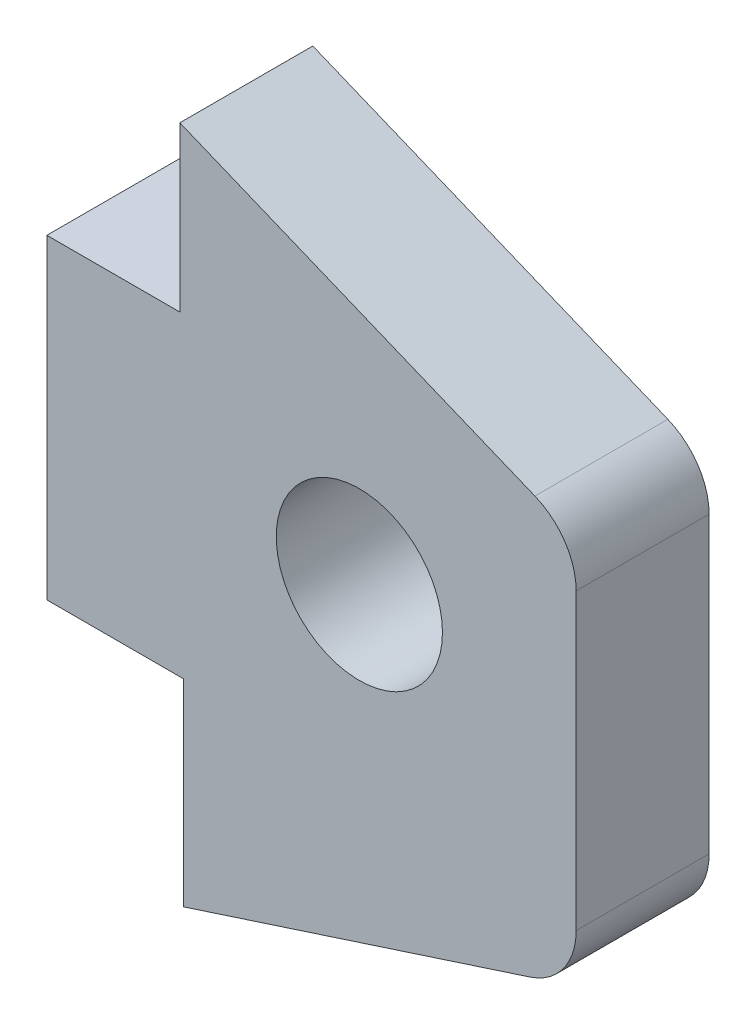
ISO-10303-21;
HEADER;
FILE_DESCRIPTION(('STEP AP214'),'2;1');
FILE_NAME('part.step','',(''),(''),'','','');
FILE_SCHEMA(('AUTOMOTIVE_DESIGN { 1 0 10303 214 1 1 1 1 }'));
ENDSEC;
DATA;
#1=APPLICATION_CONTEXT('core data for automotive mechanical design processes');
#2=APPLICATION_PROTOCOL_DEFINITION('international standard','automotive_design',2000,#1);
#3=PRODUCT_CONTEXT('',#1,'mechanical');
#4=PRODUCT('Part','Part','',(#3));
#5=PRODUCT_RELATED_PRODUCT_CATEGORY('part','',(#4));
#6=PRODUCT_DEFINITION_FORMATION('','',#4);
#7=PRODUCT_DEFINITION_CONTEXT('part definition',#1,'design');
#8=PRODUCT_DEFINITION('design','',#6,#7);
#9=PRODUCT_DEFINITION_SHAPE('','',#8);
#10=(LENGTH_UNIT() NAMED_UNIT(*) SI_UNIT(.MILLI.,.METRE.));
#11=(NAMED_UNIT(*) PLANE_ANGLE_UNIT() SI_UNIT($,.RADIAN.));
#12=(NAMED_UNIT(*) SI_UNIT($,.STERADIAN.) SOLID_ANGLE_UNIT());
#13=UNCERTAINTY_MEASURE_WITH_UNIT(LENGTH_MEASURE(1.E-05),#10,'distance_accuracy_value','');
#14=(GEOMETRIC_REPRESENTATION_CONTEXT(3) GLOBAL_UNCERTAINTY_ASSIGNED_CONTEXT((#13)) GLOBAL_UNIT_ASSIGNED_CONTEXT((#10,
#11,#12)) REPRESENTATION_CONTEXT('',''));
#15=CARTESIAN_POINT('',(0.,0.,0.));
#16=DIRECTION('',(0.,0.,1.));
#17=DIRECTION('',(1.,0.,0.));
#18=AXIS2_PLACEMENT_3D('',#15,#16,#17);
#19=CARTESIAN_POINT('',(0.,0.,4.));
#20=DIRECTION('',(0.,0.,1.));
#21=DIRECTION('',(1.,0.,0.));
#22=AXIS2_PLACEMENT_3D('',#19,#20,#21);
#23=PLANE('',#22);
#24=DIRECTION('',(0.951171408125809,0.308663169756234,0.));
#25=VECTOR('',#24,1.);
#26=CARTESIAN_POINT('',(4.10733066594974,-15.4415005076139,4.));
#27=LINE('',#26,#25);
#28=CARTESIAN_POINT('',(4.10733066594974,-15.4415005076139,4.));
#29=VERTEX_POINT('',#28);
#30=CARTESIAN_POINT('',(14.5396795010342,-12.0561150429848,4.));
#31=VERTEX_POINT('',#30);
#32=EDGE_CURVE('E173',#29,#31,#27,.T.);
#33=ORIENTED_EDGE('',*,*,#32,.T.);
#34=CARTESIAN_POINT('',(13.9223531615218,-10.1537722267332,4.));
#35=DIRECTION('',(0.,0.,1.));
#36=DIRECTION('',(1.,0.,0.));
#37=AXIS2_PLACEMENT_3D('',#34,#35,#36);
#38=CIRCLE('',#37,2.);
#39=CARTESIAN_POINT('',(15.9223531615218,-10.1537722267332,4.));
#40=VERTEX_POINT('',#39);
#41=EDGE_CURVE('E48',#31,#40,#38,.T.);
#42=ORIENTED_EDGE('',*,*,#41,.T.);
#43=DIRECTION('',(0.,1.,0.));
#44=VECTOR('',#43,1.);
#45=CARTESIAN_POINT('',(15.9223531615218,-11.6074257414156,4.));
#46=LINE('',#45,#44);
#47=CARTESIAN_POINT('',(15.9223531615218,-1.30359846331892,4.));
#48=VERTEX_POINT('',#47);
#49=EDGE_CURVE('E172',#40,#48,#46,.T.);
#50=ORIENTED_EDGE('',*,*,#49,.T.);
#51=CARTESIAN_POINT('',(13.9223531615218,-1.30359846331892,4.));
#52=DIRECTION('',(0.,0.,1.));
#53=DIRECTION('',(1.,0.,0.));
#54=AXIS2_PLACEMENT_3D('',#51,#52,#53);
#55=CIRCLE('',#54,2.);
#56=CARTESIAN_POINT('',(14.6817374813834,0.546627321483668,4.));
#57=VERTEX_POINT('',#56);
#58=EDGE_CURVE('E55',#48,#57,#55,.T.);
#59=ORIENTED_EDGE('',*,*,#58,.T.);
#60=DIRECTION('',(-0.925112892401295,0.379692159930792,0.));
#61=VECTOR('',#60,1.);
#62=CARTESIAN_POINT('',(15.9223531615218,0.037444008717305,4.));
#63=LINE('',#62,#61);
#64=CARTESIAN_POINT('',(4.,4.93071061492115,4.));
#65=VERTEX_POINT('',#64);
#66=EDGE_CURVE('E182',#57,#65,#63,.T.);
#67=ORIENTED_EDGE('',*,*,#66,.T.);
#68=DIRECTION('',(0.,-1.,0.));
#69=VECTOR('',#68,1.);
#70=CARTESIAN_POINT('',(4.,4.93071061492115,4.));
#71=LINE('',#70,#69);
#72=CARTESIAN_POINT('',(4.,0.,4.));
#73=VERTEX_POINT('',#72);
#74=EDGE_CURVE('E136',#65,#73,#71,.T.);
#75=ORIENTED_EDGE('',*,*,#74,.T.);
#76=DIRECTION('',(-1.,0.,0.));
#77=VECTOR('',#76,1.);
#78=CARTESIAN_POINT('',(4.,0.,4.));
#79=LINE('',#78,#77);
#80=CARTESIAN_POINT('',(0.,0.,4.));
#81=VERTEX_POINT('',#80);
#82=EDGE_CURVE('E131',#73,#81,#79,.T.);
#83=ORIENTED_EDGE('',*,*,#82,.T.);
#84=DIRECTION('',(0.,-1.,0.));
#85=VECTOR('',#84,1.);
#86=CARTESIAN_POINT('',(0.,0.,4.));
#87=LINE('',#86,#85);
#88=CARTESIAN_POINT('',(0.,-9.5,4.));
#89=VERTEX_POINT('',#88);
#90=EDGE_CURVE('E120',#81,#89,#87,.T.);
#91=ORIENTED_EDGE('',*,*,#90,.T.);
#92=DIRECTION('',(1.,0.,0.));
#93=VECTOR('',#92,1.);
#94=CARTESIAN_POINT('',(0.,-9.5,4.));
#95=LINE('',#94,#93);
#96=CARTESIAN_POINT('',(4.10733066594974,-9.5,4.));
#97=VERTEX_POINT('',#96);
#98=EDGE_CURVE('E130',#89,#97,#95,.T.);
#99=ORIENTED_EDGE('',*,*,#98,.T.);
#100=DIRECTION('',(0.,-1.,0.));
#101=VECTOR('',#100,1.);
#102=CARTESIAN_POINT('',(4.10733066594974,-9.5,4.));
#103=LINE('',#102,#101);
#104=EDGE_CURVE('E225',#97,#29,#103,.T.);
#105=ORIENTED_EDGE('',*,*,#104,.T.);
#106=EDGE_LOOP('',(#33,#42,#50,#59,#67,#75,#83,#91,#99,#105));
#107=FACE_BOUND('',#106,.T.);
#108=CARTESIAN_POINT('',(9.4,-4.4,4.));
#109=DIRECTION('',(0.,0.,1.));
#110=DIRECTION('',(1.,0.,0.));
#111=AXIS2_PLACEMENT_3D('',#108,#109,#110);
#112=CIRCLE('',#111,2.5);
#113=CARTESIAN_POINT('',(11.9,-4.4,4.));
#114=VERTEX_POINT('',#113);
#115=EDGE_CURVE('E235',#114,#114,#112,.T.);
#116=ORIENTED_EDGE('',*,*,#115,.F.);
#117=EDGE_LOOP('',(#116));
#118=FACE_BOUND('',#117,.T.);
#119=ADVANCED_FACE('F39',(#107,#118),#23,.T.);
#120=CARTESIAN_POINT('',(0.,0.,0.));
#121=DIRECTION('',(0.,0.,1.));
#122=DIRECTION('',(1.,0.,0.));
#123=AXIS2_PLACEMENT_3D('',#120,#121,#122);
#124=PLANE('',#123);
#125=DIRECTION('',(0.,1.,0.));
#126=VECTOR('',#125,1.);
#127=CARTESIAN_POINT('',(15.9223531615218,-11.6074257414156,0.));
#128=LINE('',#127,#126);
#129=CARTESIAN_POINT('',(15.9223531615218,-10.1537722267332,0.));
#130=VERTEX_POINT('',#129);
#131=CARTESIAN_POINT('',(15.9223531615218,-1.30359846331892,0.));
#132=VERTEX_POINT('',#131);
#133=EDGE_CURVE('E191',#130,#132,#128,.T.);
#134=ORIENTED_EDGE('',*,*,#133,.F.);
#135=CARTESIAN_POINT('',(13.9223531615218,-10.1537722267332,0.));
#136=DIRECTION('',(0.,0.,1.));
#137=DIRECTION('',(1.,0.,0.));
#138=AXIS2_PLACEMENT_3D('',#135,#136,#137);
#139=CIRCLE('',#138,2.);
#140=CARTESIAN_POINT('',(14.5396795010342,-12.0561150429848,0.));
#141=VERTEX_POINT('',#140);
#142=EDGE_CURVE('E163',#130,#141,#139,.F.);
#143=ORIENTED_EDGE('',*,*,#142,.T.);
#144=DIRECTION('',(0.951171408125809,0.308663169756234,0.));
#145=VECTOR('',#144,1.);
#146=CARTESIAN_POINT('',(4.10733066594974,-15.4415005076139,0.));
#147=LINE('',#146,#145);
#148=CARTESIAN_POINT('',(4.10733066594974,-15.4415005076139,0.));
#149=VERTEX_POINT('',#148);
#150=EDGE_CURVE('E190',#149,#141,#147,.T.);
#151=ORIENTED_EDGE('',*,*,#150,.F.);
#152=DIRECTION('',(0.,-1.,0.));
#153=VECTOR('',#152,1.);
#154=CARTESIAN_POINT('',(4.10733066594974,-9.5,0.));
#155=LINE('',#154,#153);
#156=CARTESIAN_POINT('',(4.10733066594974,-9.5,0.));
#157=VERTEX_POINT('',#156);
#158=EDGE_CURVE('E197',#157,#149,#155,.T.);
#159=ORIENTED_EDGE('',*,*,#158,.F.);
#160=DIRECTION('',(1.,0.,0.));
#161=VECTOR('',#160,1.);
#162=CARTESIAN_POINT('',(0.,-9.5,0.));
#163=LINE('',#162,#161);
#164=CARTESIAN_POINT('',(0.,-9.5,0.));
#165=VERTEX_POINT('',#164);
#166=EDGE_CURVE('E203',#165,#157,#163,.T.);
#167=ORIENTED_EDGE('',*,*,#166,.F.);
#168=DIRECTION('',(0.,-1.,0.));
#169=VECTOR('',#168,1.);
#170=CARTESIAN_POINT('',(0.,0.,0.));
#171=LINE('',#170,#169);
#172=CARTESIAN_POINT('',(0.,0.,0.));
#173=VERTEX_POINT('',#172);
#174=EDGE_CURVE('E228',#173,#165,#171,.T.);
#175=ORIENTED_EDGE('',*,*,#174,.F.);
#176=DIRECTION('',(-1.,0.,0.));
#177=VECTOR('',#176,1.);
#178=CARTESIAN_POINT('',(4.,0.,0.));
#179=LINE('',#178,#177);
#180=CARTESIAN_POINT('',(4.,0.,0.));
#181=VERTEX_POINT('',#180);
#182=EDGE_CURVE('E145',#181,#173,#179,.T.);
#183=ORIENTED_EDGE('',*,*,#182,.F.);
#184=DIRECTION('',(0.,-1.,0.));
#185=VECTOR('',#184,1.);
#186=CARTESIAN_POINT('',(4.,4.93071061492115,0.));
#187=LINE('',#186,#185);
#188=CARTESIAN_POINT('',(4.,4.93071061492115,0.));
#189=VERTEX_POINT('',#188);
#190=EDGE_CURVE('E141',#189,#181,#187,.T.);
#191=ORIENTED_EDGE('',*,*,#190,.F.);
#192=DIRECTION('',(-0.925112892401295,0.379692159930792,0.));
#193=VECTOR('',#192,1.);
#194=CARTESIAN_POINT('',(15.9223531615218,0.037444008717305,0.));
#195=LINE('',#194,#193);
#196=CARTESIAN_POINT('',(14.6817374813834,0.546627321483668,0.));
#197=VERTEX_POINT('',#196);
#198=EDGE_CURVE('E201',#197,#189,#195,.T.);
#199=ORIENTED_EDGE('',*,*,#198,.F.);
#200=CARTESIAN_POINT('',(13.9223531615218,-1.30359846331892,0.));
#201=DIRECTION('',(0.,0.,1.));
#202=DIRECTION('',(1.,0.,0.));
#203=AXIS2_PLACEMENT_3D('',#200,#201,#202);
#204=CIRCLE('',#203,2.);
#205=EDGE_CURVE('E160',#197,#132,#204,.F.);
#206=ORIENTED_EDGE('',*,*,#205,.T.);
#207=EDGE_LOOP('',(#134,#143,#151,#159,#167,#175,#183,#191,#199,#206));
#208=FACE_BOUND('',#207,.T.);
#209=CARTESIAN_POINT('',(9.4,-4.4,0.));
#210=DIRECTION('',(0.,0.,1.));
#211=DIRECTION('',(1.,0.,0.));
#212=AXIS2_PLACEMENT_3D('',#209,#210,#211);
#213=CIRCLE('',#212,2.5);
#214=CARTESIAN_POINT('',(11.9,-4.4,0.));
#215=VERTEX_POINT('',#214);
#216=EDGE_CURVE('E246',#215,#215,#213,.T.);
#217=ORIENTED_EDGE('',*,*,#216,.T.);
#218=EDGE_LOOP('',(#217));
#219=FACE_BOUND('',#218,.T.);
#220=ADVANCED_FACE('F187',(#208,#219),#124,.F.);
#221=CARTESIAN_POINT('',(4.,0.,4.));
#222=DIRECTION('',(0.,-1.,0.));
#223=DIRECTION('',(0.,0.,-1.));
#224=AXIS2_PLACEMENT_3D('',#221,#222,#223);
#225=PLANE('',#224);
#226=ORIENTED_EDGE('',*,*,#182,.T.);
#227=DIRECTION('',(0.,0.,-1.));
#228=VECTOR('',#227,1.);
#229=CARTESIAN_POINT('',(0.,0.,4.));
#230=LINE('',#229,#228);
#231=EDGE_CURVE('E124',#81,#173,#230,.T.);
#232=ORIENTED_EDGE('',*,*,#231,.F.);
#233=ORIENTED_EDGE('',*,*,#82,.F.);
#234=DIRECTION('',(0.,0.,-1.));
#235=VECTOR('',#234,1.);
#236=CARTESIAN_POINT('',(4.,0.,4.));
#237=LINE('',#236,#235);
#238=EDGE_CURVE('E211',#73,#181,#237,.T.);
#239=ORIENTED_EDGE('',*,*,#238,.T.);
#240=EDGE_LOOP('',(#226,#232,#233,#239));
#241=FACE_BOUND('',#240,.T.);
#242=ADVANCED_FACE('F143',(#241),#225,.F.);
#243=CARTESIAN_POINT('',(0.,0.,4.));
#244=DIRECTION('',(1.,0.,0.));
#245=DIRECTION('',(0.,1.,0.));
#246=AXIS2_PLACEMENT_3D('',#243,#244,#245);
#247=PLANE('',#246);
#248=ORIENTED_EDGE('',*,*,#174,.T.);
#249=DIRECTION('',(0.,0.,-1.));
#250=VECTOR('',#249,1.);
#251=CARTESIAN_POINT('',(0.,-9.5,4.));
#252=LINE('',#251,#250);
#253=EDGE_CURVE('E127',#89,#165,#252,.T.);
#254=ORIENTED_EDGE('',*,*,#253,.F.);
#255=ORIENTED_EDGE('',*,*,#90,.F.);
#256=ORIENTED_EDGE('',*,*,#231,.T.);
#257=EDGE_LOOP('',(#248,#254,#255,#256));
#258=FACE_BOUND('',#257,.T.);
#259=ADVANCED_FACE('F122',(#258),#247,.F.);
#260=CARTESIAN_POINT('',(0.,-9.5,4.));
#261=DIRECTION('',(0.,1.,0.));
#262=DIRECTION('',(0.,0.,1.));
#263=AXIS2_PLACEMENT_3D('',#260,#261,#262);
#264=PLANE('',#263);
#265=ORIENTED_EDGE('',*,*,#166,.T.);
#266=DIRECTION('',(0.,0.,-1.));
#267=VECTOR('',#266,1.);
#268=CARTESIAN_POINT('',(4.10733066594974,-9.5,4.));
#269=LINE('',#268,#267);
#270=EDGE_CURVE('E153',#97,#157,#269,.T.);
#271=ORIENTED_EDGE('',*,*,#270,.F.);
#272=ORIENTED_EDGE('',*,*,#98,.F.);
#273=ORIENTED_EDGE('',*,*,#253,.T.);
#274=EDGE_LOOP('',(#265,#271,#272,#273));
#275=FACE_BOUND('',#274,.T.);
#276=ADVANCED_FACE('F278',(#275),#264,.F.);
#277=CARTESIAN_POINT('',(4.10733066594974,-9.5,4.));
#278=DIRECTION('',(1.,0.,0.));
#279=DIRECTION('',(0.,1.,0.));
#280=AXIS2_PLACEMENT_3D('',#277,#278,#279);
#281=PLANE('',#280);
#282=ORIENTED_EDGE('',*,*,#158,.T.);
#283=DIRECTION('',(0.,0.,-1.));
#284=VECTOR('',#283,1.);
#285=CARTESIAN_POINT('',(4.10733066594974,-15.4415005076139,4.));
#286=LINE('',#285,#284);
#287=EDGE_CURVE('E195',#29,#149,#286,.T.);
#288=ORIENTED_EDGE('',*,*,#287,.F.);
#289=ORIENTED_EDGE('',*,*,#104,.F.);
#290=ORIENTED_EDGE('',*,*,#270,.T.);
#291=EDGE_LOOP('',(#282,#288,#289,#290));
#292=FACE_BOUND('',#291,.T.);
#293=ADVANCED_FACE('F224',(#292),#281,.F.);
#294=CARTESIAN_POINT('',(4.10733066594974,-15.4415005076139,4.));
#295=DIRECTION('',(-0.308663169756234,0.951171408125809,0.));
#296=DIRECTION('',(-0.951171408125809,-0.308663169756234,0.));
#297=AXIS2_PLACEMENT_3D('',#294,#295,#296);
#298=PLANE('',#297);
#299=ORIENTED_EDGE('',*,*,#150,.T.);
#300=DIRECTION('',(0.,0.,-1.));
#301=VECTOR('',#300,1.);
#302=CARTESIAN_POINT('',(14.5396795010342,-12.0561150429848,4.));
#303=LINE('',#302,#301);
#304=EDGE_CURVE('E63',#141,#31,#303,.F.);
#305=ORIENTED_EDGE('',*,*,#304,.T.);
#306=ORIENTED_EDGE('',*,*,#32,.F.);
#307=ORIENTED_EDGE('',*,*,#287,.T.);
#308=EDGE_LOOP('',(#299,#305,#306,#307));
#309=FACE_BOUND('',#308,.T.);
#310=ADVANCED_FACE('F193',(#309),#298,.F.);
#311=CARTESIAN_POINT('',(15.9223531615218,-11.6074257414156,4.));
#312=DIRECTION('',(-1.,0.,0.));
#313=DIRECTION('',(0.,-1.,0.));
#314=AXIS2_PLACEMENT_3D('',#311,#312,#313);
#315=PLANE('',#314);
#316=ORIENTED_EDGE('',*,*,#49,.F.);
#317=DIRECTION('',(0.,0.,-1.));
#318=VECTOR('',#317,1.);
#319=CARTESIAN_POINT('',(15.9223531615218,-10.1537722267332,4.));
#320=LINE('',#319,#318);
#321=EDGE_CURVE('E151',#40,#130,#320,.T.);
#322=ORIENTED_EDGE('',*,*,#321,.T.);
#323=ORIENTED_EDGE('',*,*,#133,.T.);
#324=DIRECTION('',(0.,0.,-1.));
#325=VECTOR('',#324,1.);
#326=CARTESIAN_POINT('',(15.9223531615218,-1.30359846331892,4.));
#327=LINE('',#326,#325);
#328=EDGE_CURVE('E147',#132,#48,#327,.F.);
#329=ORIENTED_EDGE('',*,*,#328,.T.);
#330=EDGE_LOOP('',(#316,#322,#323,#329));
#331=FACE_BOUND('',#330,.T.);
#332=ADVANCED_FACE('F177',(#331),#315,.F.);
#333=CARTESIAN_POINT('',(15.9223531615218,0.037444008717305,4.));
#334=DIRECTION('',(-0.379692159930792,-0.925112892401295,0.));
#335=DIRECTION('',(0.925112892401295,-0.379692159930792,0.));
#336=AXIS2_PLACEMENT_3D('',#333,#334,#335);
#337=PLANE('',#336);
#338=ORIENTED_EDGE('',*,*,#66,.F.);
#339=DIRECTION('',(0.,0.,-1.));
#340=VECTOR('',#339,1.);
#341=CARTESIAN_POINT('',(14.6817374813834,0.546627321483668,4.));
#342=LINE('',#341,#340);
#343=EDGE_CURVE('E11',#57,#197,#342,.T.);
#344=ORIENTED_EDGE('',*,*,#343,.T.);
#345=ORIENTED_EDGE('',*,*,#198,.T.);
#346=DIRECTION('',(0.,0.,-1.));
#347=VECTOR('',#346,1.);
#348=CARTESIAN_POINT('',(4.,4.93071061492115,4.));
#349=LINE('',#348,#347);
#350=EDGE_CURVE('E214',#65,#189,#349,.T.);
#351=ORIENTED_EDGE('',*,*,#350,.F.);
#352=EDGE_LOOP('',(#338,#344,#345,#351));
#353=FACE_BOUND('',#352,.T.);
#354=ADVANCED_FACE('F267',(#353),#337,.F.);
#355=CARTESIAN_POINT('',(4.,4.93071061492115,4.));
#356=DIRECTION('',(1.,0.,0.));
#357=DIRECTION('',(0.,0.,-1.));
#358=AXIS2_PLACEMENT_3D('',#355,#356,#357);
#359=PLANE('',#358);
#360=ORIENTED_EDGE('',*,*,#190,.T.);
#361=ORIENTED_EDGE('',*,*,#238,.F.);
#362=ORIENTED_EDGE('',*,*,#74,.F.);
#363=ORIENTED_EDGE('',*,*,#350,.T.);
#364=EDGE_LOOP('',(#360,#361,#362,#363));
#365=FACE_BOUND('',#364,.T.);
#366=ADVANCED_FACE('F264',(#365),#359,.F.);
#367=CARTESIAN_POINT('',(9.4,-4.4,4.));
#368=DIRECTION('',(0.,0.,-1.));
#369=DIRECTION('',(-1.,0.,0.));
#370=AXIS2_PLACEMENT_3D('',#367,#368,#369);
#371=CYLINDRICAL_SURFACE('',#370,2.5);
#372=ORIENTED_EDGE('',*,*,#115,.T.);
#373=EDGE_LOOP('',(#372));
#374=FACE_BOUND('',#373,.T.);
#375=ORIENTED_EDGE('',*,*,#216,.F.);
#376=EDGE_LOOP('',(#375));
#377=FACE_BOUND('',#376,.T.);
#378=ADVANCED_FACE('F254',(#374,#377),#371,.F.);
#379=CARTESIAN_POINT('',(13.9223531615218,-10.1537722267332,4.));
#380=DIRECTION('',(0.,0.,-1.));
#381=DIRECTION('',(-1.,0.,0.));
#382=AXIS2_PLACEMENT_3D('',#379,#380,#381);
#383=CYLINDRICAL_SURFACE('',#382,2.);
#384=ORIENTED_EDGE('',*,*,#41,.F.);
#385=ORIENTED_EDGE('',*,*,#304,.F.);
#386=ORIENTED_EDGE('',*,*,#142,.F.);
#387=ORIENTED_EDGE('',*,*,#321,.F.);
#388=EDGE_LOOP('',(#384,#385,#386,#387));
#389=FACE_BOUND('',#388,.T.);
#390=ADVANCED_FACE('F184',(#389),#383,.T.);
#391=CARTESIAN_POINT('',(13.9223531615218,-1.30359846331892,4.));
#392=DIRECTION('',(0.,0.,-1.));
#393=DIRECTION('',(-1.,0.,0.));
#394=AXIS2_PLACEMENT_3D('',#391,#392,#393);
#395=CYLINDRICAL_SURFACE('',#394,2.);
#396=ORIENTED_EDGE('',*,*,#58,.F.);
#397=ORIENTED_EDGE('',*,*,#328,.F.);
#398=ORIENTED_EDGE('',*,*,#205,.F.);
#399=ORIENTED_EDGE('',*,*,#343,.F.);
#400=EDGE_LOOP('',(#396,#397,#398,#399));
#401=FACE_BOUND('',#400,.T.);
#402=ADVANCED_FACE('F41',(#401),#395,.T.);
#403=CLOSED_SHELL('',(#119,#220,#242,#259,#276,#293,#310,#332,#354,#366,#378,#390,#402));
#404=MANIFOLD_SOLID_BREP('B2',#403);
#405=ADVANCED_BREP_SHAPE_REPRESENTATION('',(#18,#404),#14);
#406=SHAPE_DEFINITION_REPRESENTATION(#9,#405);
ENDSEC;
END-ISO-10303-21;
